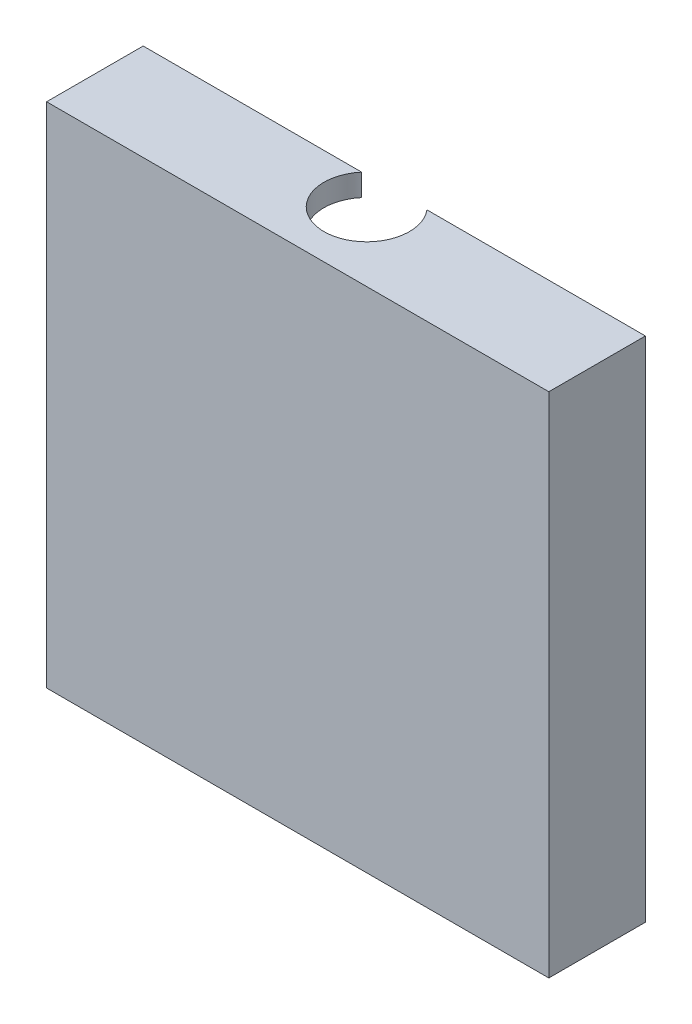
ISO-10303-21;
HEADER;
FILE_DESCRIPTION(('STEP AP214'),'2;1');
FILE_NAME('part.step','',(''),(''),'','','');
FILE_SCHEMA(('AUTOMOTIVE_DESIGN { 1 0 10303 214 1 1 1 1 }'));
ENDSEC;
DATA;
#1=APPLICATION_CONTEXT('core data for automotive mechanical design processes');
#2=APPLICATION_PROTOCOL_DEFINITION('international standard','automotive_design',2000,#1);
#3=PRODUCT_CONTEXT('',#1,'mechanical');
#4=PRODUCT('Part','Part','',(#3));
#5=PRODUCT_RELATED_PRODUCT_CATEGORY('part','',(#4));
#6=PRODUCT_DEFINITION_FORMATION('','',#4);
#7=PRODUCT_DEFINITION_CONTEXT('part definition',#1,'design');
#8=PRODUCT_DEFINITION('design','',#6,#7);
#9=PRODUCT_DEFINITION_SHAPE('','',#8);
#10=(LENGTH_UNIT() NAMED_UNIT(*) SI_UNIT(.MILLI.,.METRE.));
#11=(NAMED_UNIT(*) PLANE_ANGLE_UNIT() SI_UNIT($,.RADIAN.));
#12=(NAMED_UNIT(*) SI_UNIT($,.STERADIAN.) SOLID_ANGLE_UNIT());
#13=UNCERTAINTY_MEASURE_WITH_UNIT(LENGTH_MEASURE(1.E-05),#10,'distance_accuracy_value','');
#14=(GEOMETRIC_REPRESENTATION_CONTEXT(3) GLOBAL_UNCERTAINTY_ASSIGNED_CONTEXT((#13)) GLOBAL_UNIT_ASSIGNED_CONTEXT((#10,
#11,#12)) REPRESENTATION_CONTEXT('',''));
#15=CARTESIAN_POINT('',(0.,0.,0.));
#16=DIRECTION('',(0.,0.,1.));
#17=DIRECTION('',(1.,0.,0.));
#18=AXIS2_PLACEMENT_3D('',#15,#16,#17);
#19=CARTESIAN_POINT('',(30.25,31.4,-8.));
#20=DIRECTION('',(-1.,0.,0.));
#21=DIRECTION('',(0.,0.,1.));
#22=AXIS2_PLACEMENT_3D('',#19,#20,#21);
#23=PLANE('',#22);
#24=DIRECTION('',(0.,0.,-1.));
#25=VECTOR('',#24,1.);
#26=CARTESIAN_POINT('',(30.25,-18.4,7.));
#27=LINE('',#26,#25);
#28=CARTESIAN_POINT('',(30.25,-18.4,26.));
#29=VERTEX_POINT('',#28);
#30=CARTESIAN_POINT('',(30.25,-18.4,19.));
#31=VERTEX_POINT('',#30);
#32=EDGE_CURVE('E279',#29,#31,#27,.T.);
#33=ORIENTED_EDGE('',*,*,#32,.F.);
#34=DIRECTION('',(0.,-1.,0.));
#35=VECTOR('',#34,1.);
#36=CARTESIAN_POINT('',(30.25,0.,26.));
#37=LINE('',#36,#35);
#38=CARTESIAN_POINT('',(30.25,18.4,26.));
#39=VERTEX_POINT('',#38);
#40=EDGE_CURVE('E281',#39,#29,#37,.T.);
#41=ORIENTED_EDGE('',*,*,#40,.F.);
#42=DIRECTION('',(0.,0.,1.));
#43=VECTOR('',#42,1.);
#44=CARTESIAN_POINT('',(30.25,18.4,7.));
#45=LINE('',#44,#43);
#46=CARTESIAN_POINT('',(30.25,18.4,19.));
#47=VERTEX_POINT('',#46);
#48=EDGE_CURVE('E277',#47,#39,#45,.T.);
#49=ORIENTED_EDGE('',*,*,#48,.F.);
#50=DIRECTION('',(0.,1.,0.));
#51=VECTOR('',#50,1.);
#52=CARTESIAN_POINT('',(30.25,-10.9844410203712,19.));
#53=LINE('',#52,#51);
#54=CARTESIAN_POINT('',(30.25,16.541085212282,19.));
#55=VERTEX_POINT('',#54);
#56=EDGE_CURVE('E171',#55,#47,#53,.T.);
#57=ORIENTED_EDGE('',*,*,#56,.F.);
#58=DIRECTION('',(0.,0.,-1.));
#59=VECTOR('',#58,1.);
#60=CARTESIAN_POINT('',(30.25,16.541085212282,12.));
#61=LINE('',#60,#59);
#62=CARTESIAN_POINT('',(30.25,16.541085212282,20.6));
#63=VERTEX_POINT('',#62);
#64=EDGE_CURVE('E275',#63,#55,#61,.T.);
#65=ORIENTED_EDGE('',*,*,#64,.F.);
#66=DIRECTION('',(0.,-1.,0.));
#67=VECTOR('',#66,1.);
#68=CARTESIAN_POINT('',(30.25,0.,20.6));
#69=LINE('',#68,#67);
#70=CARTESIAN_POINT('',(30.25,-16.5410852122849,20.6));
#71=VERTEX_POINT('',#70);
#72=EDGE_CURVE('E172',#63,#71,#69,.T.);
#73=ORIENTED_EDGE('',*,*,#72,.T.);
#74=DIRECTION('',(0.,0.,-1.));
#75=VECTOR('',#74,1.);
#76=CARTESIAN_POINT('',(30.25,-16.5410852122849,12.));
#77=LINE('',#76,#75);
#78=CARTESIAN_POINT('',(30.25,-16.5410852122849,19.));
#79=VERTEX_POINT('',#78);
#80=EDGE_CURVE('E158',#71,#79,#77,.T.);
#81=ORIENTED_EDGE('',*,*,#80,.T.);
#82=EDGE_CURVE('E166',#31,#79,#53,.T.);
#83=ORIENTED_EDGE('',*,*,#82,.F.);
#84=EDGE_LOOP('',(#33,#41,#49,#57,#65,#73,#81,#83));
#85=FACE_BOUND('',#84,.T.);
#86=ADVANCED_FACE('F35',(#85),#23,.T.);
#87=CARTESIAN_POINT('',(0.,0.,24.5));
#88=DIRECTION('',(0.,0.,-1.));
#89=DIRECTION('',(-1.,0.,0.));
#90=AXIS2_PLACEMENT_3D('',#87,#88,#89);
#91=PLANE('',#90);
#92=DIRECTION('',(0.,-1.,0.));
#93=VECTOR('',#92,1.);
#94=CARTESIAN_POINT('',(37.25,15.3,24.5));
#95=LINE('',#94,#93);
#96=CARTESIAN_POINT('',(37.25,16.8,24.5));
#97=VERTEX_POINT('',#96);
#98=CARTESIAN_POINT('',(37.25,12.9,24.5));
#99=VERTEX_POINT('',#98);
#100=EDGE_CURVE('E224',#97,#99,#95,.T.);
#101=ORIENTED_EDGE('',*,*,#100,.F.);
#102=DIRECTION('',(-1.,0.,0.));
#103=VECTOR('',#102,1.);
#104=CARTESIAN_POINT('',(37.25,16.8,24.5));
#105=LINE('',#104,#103);
#106=CARTESIAN_POINT('',(65.05,16.8,24.5));
#107=VERTEX_POINT('',#106);
#108=EDGE_CURVE('E258',#107,#97,#105,.T.);
#109=ORIENTED_EDGE('',*,*,#108,.F.);
#110=DIRECTION('',(0.,1.,0.));
#111=VECTOR('',#110,1.);
#112=CARTESIAN_POINT('',(65.05,15.3,24.5));
#113=LINE('',#112,#111);
#114=CARTESIAN_POINT('',(65.0500000000001,-10.8,24.5));
#115=VERTEX_POINT('',#114);
#116=EDGE_CURVE('E236',#115,#107,#113,.T.);
#117=ORIENTED_EDGE('',*,*,#116,.F.);
#118=DIRECTION('',(1.,0.,0.));
#119=VECTOR('',#118,1.);
#120=CARTESIAN_POINT('',(31.65,-10.8,24.5));
#121=LINE('',#120,#119);
#122=CARTESIAN_POINT('',(31.65,-10.8,24.5));
#123=VERTEX_POINT('',#122);
#124=EDGE_CURVE('E233',#123,#115,#121,.T.);
#125=ORIENTED_EDGE('',*,*,#124,.F.);
#126=DIRECTION('',(0.,-1.,0.));
#127=VECTOR('',#126,1.);
#128=CARTESIAN_POINT('',(31.65,12.9,24.5));
#129=LINE('',#128,#127);
#130=CARTESIAN_POINT('',(31.65,12.9,24.5));
#131=VERTEX_POINT('',#130);
#132=EDGE_CURVE('E230',#131,#123,#129,.T.);
#133=ORIENTED_EDGE('',*,*,#132,.F.);
#134=DIRECTION('',(-1.,0.,0.));
#135=VECTOR('',#134,1.);
#136=CARTESIAN_POINT('',(37.25,12.9,24.5));
#137=LINE('',#136,#135);
#138=EDGE_CURVE('E227',#99,#131,#137,.T.);
#139=ORIENTED_EDGE('',*,*,#138,.F.);
#140=EDGE_LOOP('',(#101,#109,#117,#125,#133,#139));
#141=FACE_BOUND('',#140,.T.);
#142=ADVANCED_FACE('F321',(#141),#91,.T.);
#143=CARTESIAN_POINT('',(65.05,15.3,7.));
#144=DIRECTION('',(-1.,0.,0.));
#145=DIRECTION('',(0.,-1.,0.));
#146=AXIS2_PLACEMENT_3D('',#143,#144,#145);
#147=PLANE('',#146);
#148=DIRECTION('',(0.,0.,1.));
#149=VECTOR('',#148,1.);
#150=CARTESIAN_POINT('',(65.05,16.8,7.));
#151=LINE('',#150,#149);
#152=CARTESIAN_POINT('',(65.05,16.8,19.));
#153=VERTEX_POINT('',#152);
#154=EDGE_CURVE('E186',#153,#107,#151,.T.);
#155=ORIENTED_EDGE('',*,*,#154,.F.);
#156=DIRECTION('',(0.,-1.,0.));
#157=VECTOR('',#156,1.);
#158=CARTESIAN_POINT('',(65.05,15.3,19.));
#159=LINE('',#158,#157);
#160=CARTESIAN_POINT('',(65.0500000000001,-16.8,19.));
#161=VERTEX_POINT('',#160);
#162=EDGE_CURVE('E163',#153,#161,#159,.T.);
#163=ORIENTED_EDGE('',*,*,#162,.T.);
#164=DIRECTION('',(0.,0.,1.));
#165=VECTOR('',#164,1.);
#166=CARTESIAN_POINT('',(65.0500000000001,-16.8,7.));
#167=LINE('',#166,#165);
#168=CARTESIAN_POINT('',(65.0500000000001,-16.7999999999998,20.6));
#169=VERTEX_POINT('',#168);
#170=EDGE_CURVE('E298',#161,#169,#167,.T.);
#171=ORIENTED_EDGE('',*,*,#170,.T.);
#172=DIRECTION('',(0.,-1.,0.));
#173=VECTOR('',#172,1.);
#174=CARTESIAN_POINT('',(65.05,0.,20.6));
#175=LINE('',#174,#173);
#176=CARTESIAN_POINT('',(65.05,-10.8,20.6));
#177=VERTEX_POINT('',#176);
#178=EDGE_CURVE('E241',#177,#169,#175,.T.);
#179=ORIENTED_EDGE('',*,*,#178,.F.);
#180=DIRECTION('',(0.,0.,1.));
#181=VECTOR('',#180,1.);
#182=CARTESIAN_POINT('',(65.0500000000001,-10.8,20.6));
#183=LINE('',#182,#181);
#184=EDGE_CURVE('E257',#177,#115,#183,.T.);
#185=ORIENTED_EDGE('',*,*,#184,.T.);
#186=ORIENTED_EDGE('',*,*,#116,.T.);
#187=EDGE_LOOP('',(#155,#163,#171,#179,#185,#186));
#188=FACE_BOUND('',#187,.T.);
#189=ADVANCED_FACE('F323',(#188),#147,.T.);
#190=CARTESIAN_POINT('',(0.,-10.8,20.6));
#191=DIRECTION('',(0.,-1.,0.));
#192=DIRECTION('',(0.,0.,-1.));
#193=AXIS2_PLACEMENT_3D('',#190,#191,#192);
#194=PLANE('',#193);
#195=DIRECTION('',(0.,0.,1.));
#196=VECTOR('',#195,1.);
#197=CARTESIAN_POINT('',(31.65,-10.8,20.6));
#198=LINE('',#197,#196);
#199=CARTESIAN_POINT('',(31.65,-10.8,20.6));
#200=VERTEX_POINT('',#199);
#201=EDGE_CURVE('E254',#200,#123,#198,.T.);
#202=ORIENTED_EDGE('',*,*,#201,.T.);
#203=ORIENTED_EDGE('',*,*,#124,.T.);
#204=ORIENTED_EDGE('',*,*,#184,.F.);
#205=DIRECTION('',(1.,0.,0.));
#206=VECTOR('',#205,1.);
#207=CARTESIAN_POINT('',(0.,-10.8,20.6));
#208=LINE('',#207,#206);
#209=EDGE_CURVE('E237',#200,#177,#208,.T.);
#210=ORIENTED_EDGE('',*,*,#209,.F.);
#211=EDGE_LOOP('',(#202,#203,#204,#210));
#212=FACE_BOUND('',#211,.T.);
#213=ADVANCED_FACE('F330',(#212),#194,.F.);
#214=CARTESIAN_POINT('',(31.65,0.,20.6));
#215=DIRECTION('',(-1.,0.,0.));
#216=DIRECTION('',(0.,0.,1.));
#217=AXIS2_PLACEMENT_3D('',#214,#215,#216);
#218=PLANE('',#217);
#219=DIRECTION('',(0.,0.,1.));
#220=VECTOR('',#219,1.);
#221=CARTESIAN_POINT('',(31.65,12.9,20.6));
#222=LINE('',#221,#220);
#223=CARTESIAN_POINT('',(31.65,12.9,20.6));
#224=VERTEX_POINT('',#223);
#225=EDGE_CURVE('E251',#224,#131,#222,.T.);
#226=ORIENTED_EDGE('',*,*,#225,.T.);
#227=ORIENTED_EDGE('',*,*,#132,.T.);
#228=ORIENTED_EDGE('',*,*,#201,.F.);
#229=DIRECTION('',(0.,-1.,0.));
#230=VECTOR('',#229,1.);
#231=CARTESIAN_POINT('',(31.65,0.,20.6));
#232=LINE('',#231,#230);
#233=EDGE_CURVE('E240',#224,#200,#232,.T.);
#234=ORIENTED_EDGE('',*,*,#233,.F.);
#235=EDGE_LOOP('',(#226,#227,#228,#234));
#236=FACE_BOUND('',#235,.T.);
#237=ADVANCED_FACE('F341',(#236),#218,.F.);
#238=CARTESIAN_POINT('',(0.,12.9,20.6));
#239=DIRECTION('',(0.,1.,0.));
#240=DIRECTION('',(0.,0.,1.));
#241=AXIS2_PLACEMENT_3D('',#238,#239,#240);
#242=PLANE('',#241);
#243=DIRECTION('',(0.,0.,1.));
#244=VECTOR('',#243,1.);
#245=CARTESIAN_POINT('',(37.25,12.9,20.6));
#246=LINE('',#245,#244);
#247=CARTESIAN_POINT('',(37.25,12.9,20.6));
#248=VERTEX_POINT('',#247);
#249=EDGE_CURVE('E248',#248,#99,#246,.T.);
#250=ORIENTED_EDGE('',*,*,#249,.T.);
#251=ORIENTED_EDGE('',*,*,#138,.T.);
#252=ORIENTED_EDGE('',*,*,#225,.F.);
#253=DIRECTION('',(-1.,0.,0.));
#254=VECTOR('',#253,1.);
#255=CARTESIAN_POINT('',(0.,12.9,20.6));
#256=LINE('',#255,#254);
#257=EDGE_CURVE('E243',#248,#224,#256,.T.);
#258=ORIENTED_EDGE('',*,*,#257,.F.);
#259=EDGE_LOOP('',(#250,#251,#252,#258));
#260=FACE_BOUND('',#259,.T.);
#261=ADVANCED_FACE('F337',(#260),#242,.F.);
#262=CARTESIAN_POINT('',(37.25,0.,20.6));
#263=DIRECTION('',(-1.,0.,0.));
#264=DIRECTION('',(0.,0.,1.));
#265=AXIS2_PLACEMENT_3D('',#262,#263,#264);
#266=PLANE('',#265);
#267=DIRECTION('',(0.,0.,1.));
#268=VECTOR('',#267,1.);
#269=CARTESIAN_POINT('',(37.25,16.8,20.6));
#270=LINE('',#269,#268);
#271=CARTESIAN_POINT('',(37.25,16.8,20.6));
#272=VERTEX_POINT('',#271);
#273=EDGE_CURVE('E182',#272,#97,#270,.T.);
#274=ORIENTED_EDGE('',*,*,#273,.T.);
#275=ORIENTED_EDGE('',*,*,#100,.T.);
#276=ORIENTED_EDGE('',*,*,#249,.F.);
#277=DIRECTION('',(0.,-1.,0.));
#278=VECTOR('',#277,1.);
#279=CARTESIAN_POINT('',(37.25,0.,20.6));
#280=LINE('',#279,#278);
#281=EDGE_CURVE('E245',#272,#248,#280,.T.);
#282=ORIENTED_EDGE('',*,*,#281,.F.);
#283=EDGE_LOOP('',(#274,#275,#276,#282));
#284=FACE_BOUND('',#283,.T.);
#285=ADVANCED_FACE('F319',(#284),#266,.F.);
#286=CARTESIAN_POINT('',(29.75,-16.8,7.));
#287=DIRECTION('',(0.,1.,0.));
#288=DIRECTION('',(-1.,0.,0.));
#289=AXIS2_PLACEMENT_3D('',#286,#287,#288);
#290=PLANE('',#289);
#291=ORIENTED_EDGE('',*,*,#170,.F.);
#292=DIRECTION('',(-1.,0.,0.));
#293=VECTOR('',#292,1.);
#294=CARTESIAN_POINT('',(29.75,-16.8,19.));
#295=LINE('',#294,#293);
#296=CARTESIAN_POINT('',(30.6984535671534,-16.8,19.));
#297=VERTEX_POINT('',#296);
#298=EDGE_CURVE('E201',#161,#297,#295,.T.);
#299=ORIENTED_EDGE('',*,*,#298,.T.);
#300=DIRECTION('',(0.,0.,1.));
#301=VECTOR('',#300,1.);
#302=CARTESIAN_POINT('',(30.6984535671534,-16.8,7.));
#303=LINE('',#302,#301);
#304=CARTESIAN_POINT('',(30.6984535671534,-16.8,20.6));
#305=VERTEX_POINT('',#304);
#306=EDGE_CURVE('E160',#297,#305,#303,.T.);
#307=ORIENTED_EDGE('',*,*,#306,.T.);
#308=DIRECTION('',(-1.,0.,0.));
#309=VECTOR('',#308,1.);
#310=CARTESIAN_POINT('',(0.,-16.8000000000002,20.6));
#311=LINE('',#310,#309);
#312=EDGE_CURVE('E261',#169,#305,#311,.T.);
#313=ORIENTED_EDGE('',*,*,#312,.F.);
#314=EDGE_LOOP('',(#291,#299,#307,#313));
#315=FACE_BOUND('',#314,.T.);
#316=ADVANCED_FACE('F312',(#315),#290,.T.);
#317=CARTESIAN_POINT('',(48.45,-27.101,21.));
#318=DIRECTION('',(0.,1.,0.));
#319=DIRECTION('',(-1.,0.,0.));
#320=AXIS2_PLACEMENT_3D('',#317,#318,#319);
#321=CYLINDRICAL_SURFACE('',#320,3.1);
#322=DIRECTION('',(0.,1.,0.));
#323=VECTOR('',#322,1.);
#324=CARTESIAN_POINT('',(46.0814561435346,-27.101,19.));
#325=LINE('',#324,#323);
#326=CARTESIAN_POINT('',(46.0814561435346,18.4,19.));
#327=VERTEX_POINT('',#326);
#328=CARTESIAN_POINT('',(46.0814561435346,16.8,19.));
#329=VERTEX_POINT('',#328);
#330=EDGE_CURVE('E44',#327,#329,#325,.F.);
#331=ORIENTED_EDGE('',*,*,#330,.F.);
#332=CARTESIAN_POINT('',(48.45,18.4,21.));
#333=DIRECTION('',(0.,1.,0.));
#334=DIRECTION('',(-1.,0.,0.));
#335=AXIS2_PLACEMENT_3D('',#332,#333,#334);
#336=CIRCLE('',#335,3.1);
#337=CARTESIAN_POINT('',(50.8185438564654,18.4,19.));
#338=VERTEX_POINT('',#337);
#339=EDGE_CURVE('E290',#327,#338,#336,.T.);
#340=ORIENTED_EDGE('',*,*,#339,.T.);
#341=DIRECTION('',(0.,1.,0.));
#342=VECTOR('',#341,1.);
#343=CARTESIAN_POINT('',(50.8185438564654,-27.101,19.));
#344=LINE('',#343,#342);
#345=CARTESIAN_POINT('',(50.8185438564654,16.8,19.));
#346=VERTEX_POINT('',#345);
#347=EDGE_CURVE('E11',#346,#338,#344,.T.);
#348=ORIENTED_EDGE('',*,*,#347,.F.);
#349=CARTESIAN_POINT('',(48.45,16.8,21.));
#350=DIRECTION('',(0.,-1.,0.));
#351=DIRECTION('',(1.,0.,0.));
#352=AXIS2_PLACEMENT_3D('',#349,#350,#351);
#353=CIRCLE('',#352,3.1);
#354=EDGE_CURVE('E52',#329,#346,#353,.F.);
#355=ORIENTED_EDGE('',*,*,#354,.F.);
#356=EDGE_LOOP('',(#331,#340,#348,#355));
#357=FACE_BOUND('',#356,.T.);
#358=ADVANCED_FACE('F310',(#357),#321,.F.);
#359=CARTESIAN_POINT('',(27.25,-10.9844410203712,19.));
#360=DIRECTION('',(0.,0.,-1.));
#361=DIRECTION('',(-1.,0.,0.));
#362=AXIS2_PLACEMENT_3D('',#359,#360,#361);
#363=PLANE('',#362);
#364=DIRECTION('',(1.,0.,0.));
#365=VECTOR('',#364,1.);
#366=CARTESIAN_POINT('',(59.8500000000001,-18.4,19.));
#367=LINE('',#366,#365);
#368=CARTESIAN_POINT('',(66.6500000000001,-18.4,19.));
#369=VERTEX_POINT('',#368);
#370=EDGE_CURVE('E169',#31,#369,#367,.T.);
#371=ORIENTED_EDGE('',*,*,#370,.F.);
#372=ORIENTED_EDGE('',*,*,#82,.T.);
#373=DIRECTION('',(0.866025403784439,-0.5,0.));
#374=VECTOR('',#373,1.);
#375=CARTESIAN_POINT('',(19.106148721742,-10.1071796769735,19.));
#376=LINE('',#375,#374);
#377=EDGE_CURVE('E39',#79,#297,#376,.T.);
#378=ORIENTED_EDGE('',*,*,#377,.T.);
#379=ORIENTED_EDGE('',*,*,#298,.F.);
#380=ORIENTED_EDGE('',*,*,#162,.F.);
#381=DIRECTION('',(1.,0.,0.));
#382=VECTOR('',#381,1.);
#383=CARTESIAN_POINT('',(29.75,16.8,19.));
#384=LINE('',#383,#382);
#385=EDGE_CURVE('E199',#346,#153,#384,.T.);
#386=ORIENTED_EDGE('',*,*,#385,.F.);
#387=ORIENTED_EDGE('',*,*,#347,.T.);
#388=DIRECTION('',(-1.,0.,0.));
#389=VECTOR('',#388,1.);
#390=CARTESIAN_POINT('',(29.75,18.4,19.));
#391=LINE('',#390,#389);
#392=CARTESIAN_POINT('',(66.65,18.4,19.));
#393=VERTEX_POINT('',#392);
#394=EDGE_CURVE('E196',#393,#338,#391,.T.);
#395=ORIENTED_EDGE('',*,*,#394,.F.);
#396=DIRECTION('',(0.,1.,0.));
#397=VECTOR('',#396,1.);
#398=CARTESIAN_POINT('',(66.65,16.9,19.));
#399=LINE('',#398,#397);
#400=EDGE_CURVE('E202',#369,#393,#399,.T.);
#401=ORIENTED_EDGE('',*,*,#400,.F.);
#402=EDGE_LOOP('',(#371,#372,#378,#379,#380,#386,#387,#395,#401));
#403=FACE_BOUND('',#402,.T.);
#404=ADVANCED_FACE('F167',(#403),#363,.T.);
#405=CARTESIAN_POINT('',(66.65,16.9,7.));
#406=DIRECTION('',(1.,0.,0.));
#407=DIRECTION('',(0.,1.,0.));
#408=AXIS2_PLACEMENT_3D('',#405,#406,#407);
#409=PLANE('',#408);
#410=DIRECTION('',(0.,0.,1.));
#411=VECTOR('',#410,1.);
#412=CARTESIAN_POINT('',(66.6500000000001,-18.4,7.));
#413=LINE('',#412,#411);
#414=CARTESIAN_POINT('',(66.6500000000001,-18.4,26.));
#415=VERTEX_POINT('',#414);
#416=EDGE_CURVE('E300',#369,#415,#413,.T.);
#417=ORIENTED_EDGE('',*,*,#416,.F.);
#418=ORIENTED_EDGE('',*,*,#400,.T.);
#419=DIRECTION('',(0.,0.,1.));
#420=VECTOR('',#419,1.);
#421=CARTESIAN_POINT('',(66.65,18.4,7.));
#422=LINE('',#421,#420);
#423=CARTESIAN_POINT('',(66.65,18.4,26.));
#424=VERTEX_POINT('',#423);
#425=EDGE_CURVE('E190',#393,#424,#422,.T.);
#426=ORIENTED_EDGE('',*,*,#425,.T.);
#427=DIRECTION('',(0.,1.,0.));
#428=VECTOR('',#427,1.);
#429=CARTESIAN_POINT('',(66.65,16.9,26.));
#430=LINE('',#429,#428);
#431=EDGE_CURVE('E181',#415,#424,#430,.T.);
#432=ORIENTED_EDGE('',*,*,#431,.F.);
#433=EDGE_LOOP('',(#417,#418,#426,#432));
#434=FACE_BOUND('',#433,.T.);
#435=ADVANCED_FACE('F305',(#434),#409,.T.);
#436=CARTESIAN_POINT('',(0.,0.,26.));
#437=DIRECTION('',(0.,0.,1.));
#438=DIRECTION('',(1.,0.,0.));
#439=AXIS2_PLACEMENT_3D('',#436,#437,#438);
#440=PLANE('',#439);
#441=DIRECTION('',(-1.,0.,0.));
#442=VECTOR('',#441,1.);
#443=CARTESIAN_POINT('',(29.75,18.4,26.));
#444=LINE('',#443,#442);
#445=EDGE_CURVE('E183',#424,#39,#444,.T.);
#446=ORIENTED_EDGE('',*,*,#445,.T.);
#447=ORIENTED_EDGE('',*,*,#40,.T.);
#448=DIRECTION('',(1.,0.,0.));
#449=VECTOR('',#448,1.);
#450=CARTESIAN_POINT('',(59.8500000000001,-18.4,26.));
#451=LINE('',#450,#449);
#452=EDGE_CURVE('E179',#29,#415,#451,.T.);
#453=ORIENTED_EDGE('',*,*,#452,.T.);
#454=ORIENTED_EDGE('',*,*,#431,.T.);
#455=EDGE_LOOP('',(#446,#447,#453,#454));
#456=FACE_BOUND('',#455,.T.);
#457=ADVANCED_FACE('F306',(#456),#440,.T.);
#458=CARTESIAN_POINT('',(29.75,16.8,7.));
#459=DIRECTION('',(0.,-1.,0.));
#460=DIRECTION('',(1.,0.,0.));
#461=AXIS2_PLACEMENT_3D('',#458,#459,#460);
#462=PLANE('',#461);
#463=DIRECTION('',(0.,0.,1.));
#464=VECTOR('',#463,1.);
#465=CARTESIAN_POINT('',(30.6984535671584,16.8,7.));
#466=LINE('',#465,#464);
#467=CARTESIAN_POINT('',(30.6984535671584,16.8,19.));
#468=VERTEX_POINT('',#467);
#469=CARTESIAN_POINT('',(30.6984535671584,16.8,20.6));
#470=VERTEX_POINT('',#469);
#471=EDGE_CURVE('E212',#468,#470,#466,.T.);
#472=ORIENTED_EDGE('',*,*,#471,.F.);
#473=EDGE_CURVE('E200',#468,#329,#384,.T.);
#474=ORIENTED_EDGE('',*,*,#473,.T.);
#475=ORIENTED_EDGE('',*,*,#354,.T.);
#476=ORIENTED_EDGE('',*,*,#385,.T.);
#477=ORIENTED_EDGE('',*,*,#154,.T.);
#478=ORIENTED_EDGE('',*,*,#108,.T.);
#479=ORIENTED_EDGE('',*,*,#273,.F.);
#480=DIRECTION('',(1.,0.,0.));
#481=VECTOR('',#480,1.);
#482=CARTESIAN_POINT('',(0.,16.8,20.6));
#483=LINE('',#482,#481);
#484=EDGE_CURVE('E247',#470,#272,#483,.T.);
#485=ORIENTED_EDGE('',*,*,#484,.F.);
#486=EDGE_LOOP('',(#472,#474,#475,#476,#477,#478,#479,#485));
#487=FACE_BOUND('',#486,.T.);
#488=ADVANCED_FACE('F37',(#487),#462,.T.);
#489=DIRECTION('',(0.866025403784439,0.499999999999999,0.));
#490=VECTOR('',#489,1.);
#491=CARTESIAN_POINT('',(19.1061487217433,10.1071796769714,19.));
#492=LINE('',#491,#490);
#493=EDGE_CURVE('E192',#55,#468,#492,.T.);
#494=ORIENTED_EDGE('',*,*,#493,.F.);
#495=ORIENTED_EDGE('',*,*,#56,.T.);
#496=EDGE_CURVE('E195',#327,#47,#391,.T.);
#497=ORIENTED_EDGE('',*,*,#496,.F.);
#498=ORIENTED_EDGE('',*,*,#330,.T.);
#499=ORIENTED_EDGE('',*,*,#473,.F.);
#500=EDGE_LOOP('',(#494,#495,#497,#498,#499));
#501=FACE_BOUND('',#500,.T.);
#502=ADVANCED_FACE('F216',(#501),#363,.T.);
#503=CARTESIAN_POINT('',(0.,0.,20.6));
#504=DIRECTION('',(0.,0.,1.));
#505=DIRECTION('',(1.,0.,0.));
#506=AXIS2_PLACEMENT_3D('',#503,#504,#505);
#507=PLANE('',#506);
#508=ORIENTED_EDGE('',*,*,#72,.F.);
#509=DIRECTION('',(0.866025403784439,0.499999999999999,0.));
#510=VECTOR('',#509,1.);
#511=CARTESIAN_POINT('',(0.400000000000308,-0.692820323028085,20.6));
#512=LINE('',#511,#510);
#513=EDGE_CURVE('E187',#63,#470,#512,.T.);
#514=ORIENTED_EDGE('',*,*,#513,.T.);
#515=ORIENTED_EDGE('',*,*,#484,.T.);
#516=ORIENTED_EDGE('',*,*,#281,.T.);
#517=ORIENTED_EDGE('',*,*,#257,.T.);
#518=ORIENTED_EDGE('',*,*,#233,.T.);
#519=ORIENTED_EDGE('',*,*,#209,.T.);
#520=ORIENTED_EDGE('',*,*,#178,.T.);
#521=ORIENTED_EDGE('',*,*,#312,.T.);
#522=DIRECTION('',(0.866025403784439,-0.5,0.));
#523=VECTOR('',#522,1.);
#524=CARTESIAN_POINT('',(0.399999999999077,0.692820323025953,20.6));
#525=LINE('',#524,#523);
#526=EDGE_CURVE('E189',#71,#305,#525,.T.);
#527=ORIENTED_EDGE('',*,*,#526,.F.);
#528=EDGE_LOOP('',(#508,#514,#515,#516,#517,#518,#519,#520,#521,#527));
#529=FACE_BOUND('',#528,.T.);
#530=ADVANCED_FACE('F354',(#529),#507,.F.);
#531=CARTESIAN_POINT('',(19.1061487217433,10.1071796769714,12.));
#532=DIRECTION('',(0.499999999999999,-0.866025403784439,0.));
#533=DIRECTION('',(0.866025403784439,0.499999999999999,0.));
#534=AXIS2_PLACEMENT_3D('',#531,#532,#533);
#535=PLANE('',#534);
#536=ORIENTED_EDGE('',*,*,#513,.F.);
#537=ORIENTED_EDGE('',*,*,#64,.T.);
#538=ORIENTED_EDGE('',*,*,#493,.T.);
#539=ORIENTED_EDGE('',*,*,#471,.T.);
#540=EDGE_LOOP('',(#536,#537,#538,#539));
#541=FACE_BOUND('',#540,.T.);
#542=ADVANCED_FACE('F351',(#541),#535,.T.);
#543=CARTESIAN_POINT('',(29.75,18.4,7.));
#544=DIRECTION('',(0.,1.,0.));
#545=DIRECTION('',(-1.,0.,0.));
#546=AXIS2_PLACEMENT_3D('',#543,#544,#545);
#547=PLANE('',#546);
#548=ORIENTED_EDGE('',*,*,#496,.T.);
#549=ORIENTED_EDGE('',*,*,#48,.T.);
#550=ORIENTED_EDGE('',*,*,#445,.F.);
#551=ORIENTED_EDGE('',*,*,#425,.F.);
#552=ORIENTED_EDGE('',*,*,#394,.T.);
#553=ORIENTED_EDGE('',*,*,#339,.F.);
#554=EDGE_LOOP('',(#548,#549,#550,#551,#552,#553));
#555=FACE_BOUND('',#554,.T.);
#556=ADVANCED_FACE('F288',(#555),#547,.T.);
#557=CARTESIAN_POINT('',(19.106148721742,-10.1071796769735,12.));
#558=DIRECTION('',(-0.5,-0.866025403784439,0.));
#559=DIRECTION('',(0.866025403784439,-0.5,0.));
#560=AXIS2_PLACEMENT_3D('',#557,#558,#559);
#561=PLANE('',#560);
#562=ORIENTED_EDGE('',*,*,#80,.F.);
#563=ORIENTED_EDGE('',*,*,#526,.T.);
#564=ORIENTED_EDGE('',*,*,#306,.F.);
#565=ORIENTED_EDGE('',*,*,#377,.F.);
#566=EDGE_LOOP('',(#562,#563,#564,#565));
#567=FACE_BOUND('',#566,.T.);
#568=ADVANCED_FACE('F156',(#567),#561,.F.);
#569=CARTESIAN_POINT('',(59.8500000000001,-18.4,7.));
#570=DIRECTION('',(0.,-1.,0.));
#571=DIRECTION('',(1.,0.,0.));
#572=AXIS2_PLACEMENT_3D('',#569,#570,#571);
#573=PLANE('',#572);
#574=ORIENTED_EDGE('',*,*,#452,.F.);
#575=ORIENTED_EDGE('',*,*,#32,.T.);
#576=ORIENTED_EDGE('',*,*,#370,.T.);
#577=ORIENTED_EDGE('',*,*,#416,.T.);
#578=EDGE_LOOP('',(#574,#575,#576,#577));
#579=FACE_BOUND('',#578,.T.);
#580=ADVANCED_FACE('F308',(#579),#573,.T.);
#581=CLOSED_SHELL('',(#86,#142,#189,#213,#237,#261,#285,#316,#358,#404,#435,#457,#488,#502,#530,
#542,#556,#568,#580));
#582=MANIFOLD_SOLID_BREP('B2',#581);
#583=ADVANCED_BREP_SHAPE_REPRESENTATION('',(#18,#582),#14);
#584=SHAPE_DEFINITION_REPRESENTATION(#9,#583);
ENDSEC;
END-ISO-10303-21;
